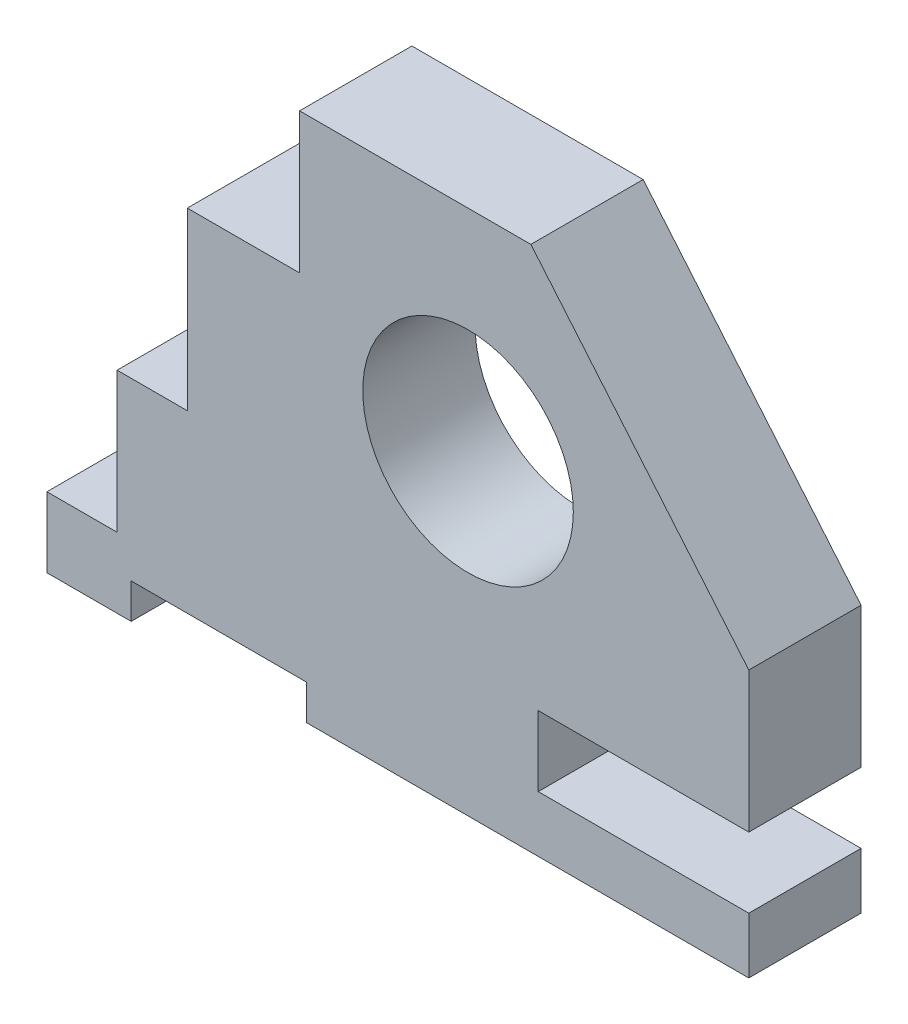
ISO-10303-21;
HEADER;
FILE_DESCRIPTION(('STEP AP214'),'2;1');
FILE_NAME('part.step','',(''),(''),'','','');
FILE_SCHEMA(('AUTOMOTIVE_DESIGN { 1 0 10303 214 1 1 1 1 }'));
ENDSEC;
DATA;
#1=APPLICATION_CONTEXT('core data for automotive mechanical design processes');
#2=APPLICATION_PROTOCOL_DEFINITION('international standard','automotive_design',2000,#1);
#3=PRODUCT_CONTEXT('',#1,'mechanical');
#4=PRODUCT('Part','Part','',(#3));
#5=PRODUCT_RELATED_PRODUCT_CATEGORY('part','',(#4));
#6=PRODUCT_DEFINITION_FORMATION('','',#4);
#7=PRODUCT_DEFINITION_CONTEXT('part definition',#1,'design');
#8=PRODUCT_DEFINITION('design','',#6,#7);
#9=PRODUCT_DEFINITION_SHAPE('','',#8);
#10=(LENGTH_UNIT() NAMED_UNIT(*) SI_UNIT(.MILLI.,.METRE.));
#11=(NAMED_UNIT(*) PLANE_ANGLE_UNIT() SI_UNIT($,.RADIAN.));
#12=(NAMED_UNIT(*) SI_UNIT($,.STERADIAN.) SOLID_ANGLE_UNIT());
#13=UNCERTAINTY_MEASURE_WITH_UNIT(LENGTH_MEASURE(1.E-05),#10,'distance_accuracy_value','');
#14=(GEOMETRIC_REPRESENTATION_CONTEXT(3) GLOBAL_UNCERTAINTY_ASSIGNED_CONTEXT((#13)) GLOBAL_UNIT_ASSIGNED_CONTEXT((#10,
#11,#12)) REPRESENTATION_CONTEXT('',''));
#15=CARTESIAN_POINT('',(0.,0.,0.));
#16=DIRECTION('',(0.,0.,1.));
#17=DIRECTION('',(1.,0.,0.));
#18=AXIS2_PLACEMENT_3D('',#15,#16,#17);
#19=CARTESIAN_POINT('',(0.,0.,16.));
#20=DIRECTION('',(0.,0.,1.));
#21=DIRECTION('',(1.,0.,0.));
#22=AXIS2_PLACEMENT_3D('',#19,#20,#21);
#23=PLANE('',#22);
#24=DIRECTION('',(1.,0.,0.));
#25=VECTOR('',#24,1.);
#26=CARTESIAN_POINT('',(-38.,-37.5,16.));
#27=LINE('',#26,#25);
#28=CARTESIAN_POINT('',(-50.,-37.5,16.));
#29=VERTEX_POINT('',#28);
#30=CARTESIAN_POINT('',(-38.,-37.5,16.));
#31=VERTEX_POINT('',#30);
#32=EDGE_CURVE('E263',#29,#31,#27,.T.);
#33=ORIENTED_EDGE('',*,*,#32,.T.);
#34=DIRECTION('',(0.,1.,0.));
#35=VECTOR('',#34,1.);
#36=CARTESIAN_POINT('',(-38.,-37.5,16.));
#37=LINE('',#36,#35);
#38=CARTESIAN_POINT('',(-38.,-32.5,16.));
#39=VERTEX_POINT('',#38);
#40=EDGE_CURVE('E132',#31,#39,#37,.T.);
#41=ORIENTED_EDGE('',*,*,#40,.T.);
#42=DIRECTION('',(1.,0.,0.));
#43=VECTOR('',#42,1.);
#44=CARTESIAN_POINT('',(-38.,-32.5,16.));
#45=LINE('',#44,#43);
#46=CARTESIAN_POINT('',(-13.,-32.5,16.));
#47=VERTEX_POINT('',#46);
#48=EDGE_CURVE('E329',#39,#47,#45,.T.);
#49=ORIENTED_EDGE('',*,*,#48,.T.);
#50=DIRECTION('',(0.,-1.,0.));
#51=VECTOR('',#50,1.);
#52=CARTESIAN_POINT('',(-13.,-37.5,16.));
#53=LINE('',#52,#51);
#54=CARTESIAN_POINT('',(-13.,-37.5,16.));
#55=VERTEX_POINT('',#54);
#56=EDGE_CURVE('E349',#47,#55,#53,.T.);
#57=ORIENTED_EDGE('',*,*,#56,.T.);
#58=DIRECTION('',(1.,0.,0.));
#59=VECTOR('',#58,1.);
#60=CARTESIAN_POINT('',(50.,-37.5,16.));
#61=LINE('',#60,#59);
#62=CARTESIAN_POINT('',(50.,-37.5,16.));
#63=VERTEX_POINT('',#62);
#64=EDGE_CURVE('E345',#55,#63,#61,.T.);
#65=ORIENTED_EDGE('',*,*,#64,.T.);
#66=DIRECTION('',(0.,1.,0.));
#67=VECTOR('',#66,1.);
#68=CARTESIAN_POINT('',(50.,-29.5,16.));
#69=LINE('',#68,#67);
#70=CARTESIAN_POINT('',(50.,-29.5,16.));
#71=VERTEX_POINT('',#70);
#72=EDGE_CURVE('E348',#63,#71,#69,.T.);
#73=ORIENTED_EDGE('',*,*,#72,.T.);
#74=DIRECTION('',(-1.,0.,0.));
#75=VECTOR('',#74,1.);
#76=CARTESIAN_POINT('',(20.,-29.5,16.));
#77=LINE('',#76,#75);
#78=CARTESIAN_POINT('',(20.,-29.5,16.));
#79=VERTEX_POINT('',#78);
#80=EDGE_CURVE('E354',#71,#79,#77,.T.);
#81=ORIENTED_EDGE('',*,*,#80,.T.);
#82=DIRECTION('',(0.,1.,0.));
#83=VECTOR('',#82,1.);
#84=CARTESIAN_POINT('',(20.,-29.5,16.));
#85=LINE('',#84,#83);
#86=CARTESIAN_POINT('',(20.,-19.5,16.));
#87=VERTEX_POINT('',#86);
#88=EDGE_CURVE('E361',#79,#87,#85,.T.);
#89=ORIENTED_EDGE('',*,*,#88,.T.);
#90=DIRECTION('',(1.,0.,0.));
#91=VECTOR('',#90,1.);
#92=CARTESIAN_POINT('',(20.,-19.5,16.));
#93=LINE('',#92,#91);
#94=CARTESIAN_POINT('',(50.,-19.5,16.));
#95=VERTEX_POINT('',#94);
#96=EDGE_CURVE('E364',#87,#95,#93,.T.);
#97=ORIENTED_EDGE('',*,*,#96,.T.);
#98=DIRECTION('',(0.,1.,0.));
#99=VECTOR('',#98,1.);
#100=CARTESIAN_POINT('',(50.,0.499999999999966,16.));
#101=LINE('',#100,#99);
#102=CARTESIAN_POINT('',(50.,0.499999999999966,16.));
#103=VERTEX_POINT('',#102);
#104=EDGE_CURVE('E367',#95,#103,#101,.T.);
#105=ORIENTED_EDGE('',*,*,#104,.T.);
#106=DIRECTION('',(-0.642787609686541,0.766044443118977,0.));
#107=VECTOR('',#106,1.);
#108=CARTESIAN_POINT('',(18.9533136464405,37.5,16.));
#109=LINE('',#108,#107);
#110=CARTESIAN_POINT('',(18.9533136464405,37.5,16.));
#111=VERTEX_POINT('',#110);
#112=EDGE_CURVE('E370',#103,#111,#109,.T.);
#113=ORIENTED_EDGE('',*,*,#112,.T.);
#114=DIRECTION('',(-1.,0.,0.));
#115=VECTOR('',#114,1.);
#116=CARTESIAN_POINT('',(18.9533136464405,37.5,16.));
#117=LINE('',#116,#115);
#118=CARTESIAN_POINT('',(-14.,37.5,16.));
#119=VERTEX_POINT('',#118);
#120=EDGE_CURVE('E373',#111,#119,#117,.T.);
#121=ORIENTED_EDGE('',*,*,#120,.T.);
#122=DIRECTION('',(0.,-1.,0.));
#123=VECTOR('',#122,1.);
#124=CARTESIAN_POINT('',(-14.,37.5,16.));
#125=LINE('',#124,#123);
#126=CARTESIAN_POINT('',(-14.,17.5,16.));
#127=VERTEX_POINT('',#126);
#128=EDGE_CURVE('E376',#119,#127,#125,.T.);
#129=ORIENTED_EDGE('',*,*,#128,.T.);
#130=DIRECTION('',(-1.,0.,0.));
#131=VECTOR('',#130,1.);
#132=CARTESIAN_POINT('',(-30.,17.5,16.));
#133=LINE('',#132,#131);
#134=CARTESIAN_POINT('',(-30.,17.5,16.));
#135=VERTEX_POINT('',#134);
#136=EDGE_CURVE('E379',#127,#135,#133,.T.);
#137=ORIENTED_EDGE('',*,*,#136,.T.);
#138=DIRECTION('',(0.,-1.,0.));
#139=VECTOR('',#138,1.);
#140=CARTESIAN_POINT('',(-30.,17.5,16.));
#141=LINE('',#140,#139);
#142=CARTESIAN_POINT('',(-30.,-7.50000000000002,16.));
#143=VERTEX_POINT('',#142);
#144=EDGE_CURVE('E382',#135,#143,#141,.T.);
#145=ORIENTED_EDGE('',*,*,#144,.T.);
#146=DIRECTION('',(-1.,0.,0.));
#147=VECTOR('',#146,1.);
#148=CARTESIAN_POINT('',(-40.,-7.50000000000002,16.));
#149=LINE('',#148,#147);
#150=CARTESIAN_POINT('',(-40.,-7.50000000000002,16.));
#151=VERTEX_POINT('',#150);
#152=EDGE_CURVE('E184',#143,#151,#149,.T.);
#153=ORIENTED_EDGE('',*,*,#152,.T.);
#154=DIRECTION('',(0.,-1.,0.));
#155=VECTOR('',#154,1.);
#156=CARTESIAN_POINT('',(-40.,-7.50000000000002,16.));
#157=LINE('',#156,#155);
#158=CARTESIAN_POINT('',(-40.,-27.5,16.));
#159=VERTEX_POINT('',#158);
#160=EDGE_CURVE('E178',#151,#159,#157,.T.);
#161=ORIENTED_EDGE('',*,*,#160,.T.);
#162=DIRECTION('',(-1.,0.,0.));
#163=VECTOR('',#162,1.);
#164=CARTESIAN_POINT('',(-50.,-27.5,16.));
#165=LINE('',#164,#163);
#166=CARTESIAN_POINT('',(-50.,-27.5,16.));
#167=VERTEX_POINT('',#166);
#168=EDGE_CURVE('E182',#159,#167,#165,.T.);
#169=ORIENTED_EDGE('',*,*,#168,.T.);
#170=DIRECTION('',(0.,-1.,0.));
#171=VECTOR('',#170,1.);
#172=CARTESIAN_POINT('',(-50.,-27.5,16.));
#173=LINE('',#172,#171);
#174=EDGE_CURVE('E56',#167,#29,#173,.T.);
#175=ORIENTED_EDGE('',*,*,#174,.T.);
#176=EDGE_LOOP('',(#33,#41,#49,#57,#65,#73,#81,#89,#97,#105,#113,#121,#129,#137,#145,#153,#161,
#169,#175));
#177=FACE_BOUND('',#176,.T.);
#178=CARTESIAN_POINT('',(10.,7.49999999999996,16.));
#179=DIRECTION('',(0.,0.,1.));
#180=DIRECTION('',(1.,0.,0.));
#181=AXIS2_PLACEMENT_3D('',#178,#179,#180);
#182=CIRCLE('',#181,15.);
#183=CARTESIAN_POINT('',(25.,7.49999999999996,16.));
#184=VERTEX_POINT('',#183);
#185=EDGE_CURVE('E212',#184,#184,#182,.T.);
#186=ORIENTED_EDGE('',*,*,#185,.F.);
#187=EDGE_LOOP('',(#186));
#188=FACE_BOUND('',#187,.T.);
#189=ADVANCED_FACE('F38',(#177,#188),#23,.T.);
#190=CARTESIAN_POINT('',(0.,0.,0.));
#191=DIRECTION('',(0.,0.,1.));
#192=DIRECTION('',(1.,0.,0.));
#193=AXIS2_PLACEMENT_3D('',#190,#191,#192);
#194=PLANE('',#193);
#195=DIRECTION('',(1.,0.,0.));
#196=VECTOR('',#195,1.);
#197=CARTESIAN_POINT('',(-38.,-37.5,0.));
#198=LINE('',#197,#196);
#199=CARTESIAN_POINT('',(-50.,-37.5,0.));
#200=VERTEX_POINT('',#199);
#201=CARTESIAN_POINT('',(-38.,-37.5,0.));
#202=VERTEX_POINT('',#201);
#203=EDGE_CURVE('E207',#200,#202,#198,.T.);
#204=ORIENTED_EDGE('',*,*,#203,.F.);
#205=DIRECTION('',(0.,-1.,0.));
#206=VECTOR('',#205,1.);
#207=CARTESIAN_POINT('',(-50.,-27.5,0.));
#208=LINE('',#207,#206);
#209=CARTESIAN_POINT('',(-50.,-27.5,0.));
#210=VERTEX_POINT('',#209);
#211=EDGE_CURVE('E124',#210,#200,#208,.T.);
#212=ORIENTED_EDGE('',*,*,#211,.F.);
#213=DIRECTION('',(-1.,0.,0.));
#214=VECTOR('',#213,1.);
#215=CARTESIAN_POINT('',(-50.,-27.5,0.));
#216=LINE('',#215,#214);
#217=CARTESIAN_POINT('',(-40.,-27.5,0.));
#218=VERTEX_POINT('',#217);
#219=EDGE_CURVE('E118',#218,#210,#216,.T.);
#220=ORIENTED_EDGE('',*,*,#219,.F.);
#221=DIRECTION('',(0.,-1.,0.));
#222=VECTOR('',#221,1.);
#223=CARTESIAN_POINT('',(-40.,-7.50000000000002,0.));
#224=LINE('',#223,#222);
#225=CARTESIAN_POINT('',(-40.,-7.50000000000002,0.));
#226=VERTEX_POINT('',#225);
#227=EDGE_CURVE('E193',#226,#218,#224,.T.);
#228=ORIENTED_EDGE('',*,*,#227,.F.);
#229=DIRECTION('',(-1.,0.,0.));
#230=VECTOR('',#229,1.);
#231=CARTESIAN_POINT('',(-40.,-7.50000000000002,0.));
#232=LINE('',#231,#230);
#233=CARTESIAN_POINT('',(-30.,-7.50000000000002,0.));
#234=VERTEX_POINT('',#233);
#235=EDGE_CURVE('E254',#234,#226,#232,.T.);
#236=ORIENTED_EDGE('',*,*,#235,.F.);
#237=DIRECTION('',(0.,-1.,0.));
#238=VECTOR('',#237,1.);
#239=CARTESIAN_POINT('',(-30.,17.5,0.));
#240=LINE('',#239,#238);
#241=CARTESIAN_POINT('',(-30.,17.5,0.));
#242=VERTEX_POINT('',#241);
#243=EDGE_CURVE('E251',#242,#234,#240,.T.);
#244=ORIENTED_EDGE('',*,*,#243,.F.);
#245=DIRECTION('',(-1.,0.,0.));
#246=VECTOR('',#245,1.);
#247=CARTESIAN_POINT('',(-30.,17.5,0.));
#248=LINE('',#247,#246);
#249=CARTESIAN_POINT('',(-14.,17.5,0.));
#250=VERTEX_POINT('',#249);
#251=EDGE_CURVE('E248',#250,#242,#248,.T.);
#252=ORIENTED_EDGE('',*,*,#251,.F.);
#253=DIRECTION('',(0.,-1.,0.));
#254=VECTOR('',#253,1.);
#255=CARTESIAN_POINT('',(-14.,37.5,0.));
#256=LINE('',#255,#254);
#257=CARTESIAN_POINT('',(-14.,37.5,0.));
#258=VERTEX_POINT('',#257);
#259=EDGE_CURVE('E245',#258,#250,#256,.T.);
#260=ORIENTED_EDGE('',*,*,#259,.F.);
#261=DIRECTION('',(-1.,0.,0.));
#262=VECTOR('',#261,1.);
#263=CARTESIAN_POINT('',(18.9533136464405,37.5,0.));
#264=LINE('',#263,#262);
#265=CARTESIAN_POINT('',(18.9533136464405,37.5,0.));
#266=VERTEX_POINT('',#265);
#267=EDGE_CURVE('E242',#266,#258,#264,.T.);
#268=ORIENTED_EDGE('',*,*,#267,.F.);
#269=DIRECTION('',(-0.642787609686541,0.766044443118977,0.));
#270=VECTOR('',#269,1.);
#271=CARTESIAN_POINT('',(18.9533136464405,37.5,0.));
#272=LINE('',#271,#270);
#273=CARTESIAN_POINT('',(50.,0.499999999999966,0.));
#274=VERTEX_POINT('',#273);
#275=EDGE_CURVE('E239',#274,#266,#272,.T.);
#276=ORIENTED_EDGE('',*,*,#275,.F.);
#277=DIRECTION('',(0.,1.,0.));
#278=VECTOR('',#277,1.);
#279=CARTESIAN_POINT('',(50.,0.499999999999966,0.));
#280=LINE('',#279,#278);
#281=CARTESIAN_POINT('',(50.,-19.5,0.));
#282=VERTEX_POINT('',#281);
#283=EDGE_CURVE('E236',#282,#274,#280,.T.);
#284=ORIENTED_EDGE('',*,*,#283,.F.);
#285=DIRECTION('',(1.,0.,0.));
#286=VECTOR('',#285,1.);
#287=CARTESIAN_POINT('',(20.,-19.5,0.));
#288=LINE('',#287,#286);
#289=CARTESIAN_POINT('',(20.,-19.5,0.));
#290=VERTEX_POINT('',#289);
#291=EDGE_CURVE('E233',#290,#282,#288,.T.);
#292=ORIENTED_EDGE('',*,*,#291,.F.);
#293=DIRECTION('',(0.,1.,0.));
#294=VECTOR('',#293,1.);
#295=CARTESIAN_POINT('',(20.,-29.5,0.));
#296=LINE('',#295,#294);
#297=CARTESIAN_POINT('',(20.,-29.5,0.));
#298=VERTEX_POINT('',#297);
#299=EDGE_CURVE('E230',#298,#290,#296,.T.);
#300=ORIENTED_EDGE('',*,*,#299,.F.);
#301=DIRECTION('',(-1.,0.,0.));
#302=VECTOR('',#301,1.);
#303=CARTESIAN_POINT('',(20.,-29.5,0.));
#304=LINE('',#303,#302);
#305=CARTESIAN_POINT('',(50.,-29.5,0.));
#306=VERTEX_POINT('',#305);
#307=EDGE_CURVE('E227',#306,#298,#304,.T.);
#308=ORIENTED_EDGE('',*,*,#307,.F.);
#309=DIRECTION('',(0.,1.,0.));
#310=VECTOR('',#309,1.);
#311=CARTESIAN_POINT('',(50.,-29.5,0.));
#312=LINE('',#311,#310);
#313=CARTESIAN_POINT('',(50.,-37.5,0.));
#314=VERTEX_POINT('',#313);
#315=EDGE_CURVE('E224',#314,#306,#312,.T.);
#316=ORIENTED_EDGE('',*,*,#315,.F.);
#317=DIRECTION('',(1.,0.,0.));
#318=VECTOR('',#317,1.);
#319=CARTESIAN_POINT('',(50.,-37.5,0.));
#320=LINE('',#319,#318);
#321=CARTESIAN_POINT('',(-13.,-37.5,0.));
#322=VERTEX_POINT('',#321);
#323=EDGE_CURVE('E221',#322,#314,#320,.T.);
#324=ORIENTED_EDGE('',*,*,#323,.F.);
#325=DIRECTION('',(0.,-1.,0.));
#326=VECTOR('',#325,1.);
#327=CARTESIAN_POINT('',(-13.,-37.5,0.));
#328=LINE('',#327,#326);
#329=CARTESIAN_POINT('',(-13.,-32.5,0.));
#330=VERTEX_POINT('',#329);
#331=EDGE_CURVE('E218',#330,#322,#328,.T.);
#332=ORIENTED_EDGE('',*,*,#331,.F.);
#333=DIRECTION('',(1.,0.,0.));
#334=VECTOR('',#333,1.);
#335=CARTESIAN_POINT('',(-38.,-32.5,0.));
#336=LINE('',#335,#334);
#337=CARTESIAN_POINT('',(-38.,-32.5,0.));
#338=VERTEX_POINT('',#337);
#339=EDGE_CURVE('E215',#338,#330,#336,.T.);
#340=ORIENTED_EDGE('',*,*,#339,.F.);
#341=DIRECTION('',(0.,1.,0.));
#342=VECTOR('',#341,1.);
#343=CARTESIAN_POINT('',(-38.,-37.5,0.));
#344=LINE('',#343,#342);
#345=EDGE_CURVE('E211',#202,#338,#344,.T.);
#346=ORIENTED_EDGE('',*,*,#345,.F.);
#347=EDGE_LOOP('',(#204,#212,#220,#228,#236,#244,#252,#260,#268,#276,#284,#292,#300,#308,#316,
#324,#332,#340,#346));
#348=FACE_BOUND('',#347,.T.);
#349=CARTESIAN_POINT('',(10.,7.49999999999996,0.));
#350=DIRECTION('',(0.,0.,1.));
#351=DIRECTION('',(1.,0.,0.));
#352=AXIS2_PLACEMENT_3D('',#349,#350,#351);
#353=CIRCLE('',#352,15.);
#354=CARTESIAN_POINT('',(25.,7.49999999999996,0.));
#355=VERTEX_POINT('',#354);
#356=EDGE_CURVE('E678',#355,#355,#353,.T.);
#357=ORIENTED_EDGE('',*,*,#356,.T.);
#358=EDGE_LOOP('',(#357));
#359=FACE_BOUND('',#358,.T.);
#360=ADVANCED_FACE('F333',(#348,#359),#194,.F.);
#361=CARTESIAN_POINT('',(-38.,-37.5,16.));
#362=DIRECTION('',(0.,1.,0.));
#363=DIRECTION('',(-1.,0.,0.));
#364=AXIS2_PLACEMENT_3D('',#361,#362,#363);
#365=PLANE('',#364);
#366=ORIENTED_EDGE('',*,*,#203,.T.);
#367=DIRECTION('',(0.,0.,-1.));
#368=VECTOR('',#367,1.);
#369=CARTESIAN_POINT('',(-38.,-37.5,16.));
#370=LINE('',#369,#368);
#371=EDGE_CURVE('E11',#31,#202,#370,.T.);
#372=ORIENTED_EDGE('',*,*,#371,.F.);
#373=ORIENTED_EDGE('',*,*,#32,.F.);
#374=DIRECTION('',(0.,0.,-1.));
#375=VECTOR('',#374,1.);
#376=CARTESIAN_POINT('',(-50.,-37.5,16.));
#377=LINE('',#376,#375);
#378=EDGE_CURVE('E203',#29,#200,#377,.T.);
#379=ORIENTED_EDGE('',*,*,#378,.T.);
#380=EDGE_LOOP('',(#366,#372,#373,#379));
#381=FACE_BOUND('',#380,.T.);
#382=ADVANCED_FACE('F40',(#381),#365,.F.);
#383=CARTESIAN_POINT('',(-38.,-37.5,16.));
#384=DIRECTION('',(-1.,0.,0.));
#385=DIRECTION('',(0.,0.,1.));
#386=AXIS2_PLACEMENT_3D('',#383,#384,#385);
#387=PLANE('',#386);
#388=ORIENTED_EDGE('',*,*,#345,.T.);
#389=DIRECTION('',(0.,0.,-1.));
#390=VECTOR('',#389,1.);
#391=CARTESIAN_POINT('',(-38.,-32.5,16.));
#392=LINE('',#391,#390);
#393=EDGE_CURVE('E48',#39,#338,#392,.T.);
#394=ORIENTED_EDGE('',*,*,#393,.F.);
#395=ORIENTED_EDGE('',*,*,#40,.F.);
#396=ORIENTED_EDGE('',*,*,#371,.T.);
#397=EDGE_LOOP('',(#388,#394,#395,#396));
#398=FACE_BOUND('',#397,.T.);
#399=ADVANCED_FACE('F430',(#398),#387,.F.);
#400=CARTESIAN_POINT('',(-38.,-32.5,16.));
#401=DIRECTION('',(0.,1.,0.));
#402=DIRECTION('',(0.,0.,1.));
#403=AXIS2_PLACEMENT_3D('',#400,#401,#402);
#404=PLANE('',#403);
#405=ORIENTED_EDGE('',*,*,#339,.T.);
#406=DIRECTION('',(0.,0.,-1.));
#407=VECTOR('',#406,1.);
#408=CARTESIAN_POINT('',(-13.,-32.5,16.));
#409=LINE('',#408,#407);
#410=EDGE_CURVE('E318',#47,#330,#409,.T.);
#411=ORIENTED_EDGE('',*,*,#410,.F.);
#412=ORIENTED_EDGE('',*,*,#48,.F.);
#413=ORIENTED_EDGE('',*,*,#393,.T.);
#414=EDGE_LOOP('',(#405,#411,#412,#413));
#415=FACE_BOUND('',#414,.T.);
#416=ADVANCED_FACE('F327',(#415),#404,.F.);
#417=CARTESIAN_POINT('',(-13.,-37.5,16.));
#418=DIRECTION('',(1.,0.,0.));
#419=DIRECTION('',(0.,0.,-1.));
#420=AXIS2_PLACEMENT_3D('',#417,#418,#419);
#421=PLANE('',#420);
#422=ORIENTED_EDGE('',*,*,#331,.T.);
#423=DIRECTION('',(0.,0.,-1.));
#424=VECTOR('',#423,1.);
#425=CARTESIAN_POINT('',(-13.,-37.5,16.));
#426=LINE('',#425,#424);
#427=EDGE_CURVE('E314',#55,#322,#426,.T.);
#428=ORIENTED_EDGE('',*,*,#427,.F.);
#429=ORIENTED_EDGE('',*,*,#56,.F.);
#430=ORIENTED_EDGE('',*,*,#410,.T.);
#431=EDGE_LOOP('',(#422,#428,#429,#430));
#432=FACE_BOUND('',#431,.T.);
#433=ADVANCED_FACE('F339',(#432),#421,.F.);
#434=CARTESIAN_POINT('',(50.,-37.5,16.));
#435=DIRECTION('',(0.,1.,0.));
#436=DIRECTION('',(-1.,0.,0.));
#437=AXIS2_PLACEMENT_3D('',#434,#435,#436);
#438=PLANE('',#437);
#439=ORIENTED_EDGE('',*,*,#323,.T.);
#440=DIRECTION('',(0.,0.,-1.));
#441=VECTOR('',#440,1.);
#442=CARTESIAN_POINT('',(50.,-37.5,16.));
#443=LINE('',#442,#441);
#444=EDGE_CURVE('E310',#63,#314,#443,.T.);
#445=ORIENTED_EDGE('',*,*,#444,.F.);
#446=ORIENTED_EDGE('',*,*,#64,.F.);
#447=ORIENTED_EDGE('',*,*,#427,.T.);
#448=EDGE_LOOP('',(#439,#445,#446,#447));
#449=FACE_BOUND('',#448,.T.);
#450=ADVANCED_FACE('F343',(#449),#438,.F.);
#451=CARTESIAN_POINT('',(50.,-29.5,16.));
#452=DIRECTION('',(-1.,0.,0.));
#453=DIRECTION('',(0.,-1.,0.));
#454=AXIS2_PLACEMENT_3D('',#451,#452,#453);
#455=PLANE('',#454);
#456=ORIENTED_EDGE('',*,*,#315,.T.);
#457=DIRECTION('',(0.,0.,-1.));
#458=VECTOR('',#457,1.);
#459=CARTESIAN_POINT('',(50.,-29.5,16.));
#460=LINE('',#459,#458);
#461=EDGE_CURVE('E306',#71,#306,#460,.T.);
#462=ORIENTED_EDGE('',*,*,#461,.F.);
#463=ORIENTED_EDGE('',*,*,#72,.F.);
#464=ORIENTED_EDGE('',*,*,#444,.T.);
#465=EDGE_LOOP('',(#456,#462,#463,#464));
#466=FACE_BOUND('',#465,.T.);
#467=ADVANCED_FACE('F443',(#466),#455,.F.);
#468=CARTESIAN_POINT('',(20.,-29.5,16.));
#469=DIRECTION('',(0.,-1.,0.));
#470=DIRECTION('',(0.,0.,-1.));
#471=AXIS2_PLACEMENT_3D('',#468,#469,#470);
#472=PLANE('',#471);
#473=ORIENTED_EDGE('',*,*,#307,.T.);
#474=DIRECTION('',(0.,0.,-1.));
#475=VECTOR('',#474,1.);
#476=CARTESIAN_POINT('',(20.,-29.5,16.));
#477=LINE('',#476,#475);
#478=EDGE_CURVE('E302',#79,#298,#477,.T.);
#479=ORIENTED_EDGE('',*,*,#478,.F.);
#480=ORIENTED_EDGE('',*,*,#80,.F.);
#481=ORIENTED_EDGE('',*,*,#461,.T.);
#482=EDGE_LOOP('',(#473,#479,#480,#481));
#483=FACE_BOUND('',#482,.T.);
#484=ADVANCED_FACE('F446',(#483),#472,.F.);
#485=CARTESIAN_POINT('',(20.,-29.5,16.));
#486=DIRECTION('',(-1.,0.,0.));
#487=DIRECTION('',(0.,0.,1.));
#488=AXIS2_PLACEMENT_3D('',#485,#486,#487);
#489=PLANE('',#488);
#490=ORIENTED_EDGE('',*,*,#299,.T.);
#491=DIRECTION('',(0.,0.,-1.));
#492=VECTOR('',#491,1.);
#493=CARTESIAN_POINT('',(20.,-19.5,16.));
#494=LINE('',#493,#492);
#495=EDGE_CURVE('E298',#87,#290,#494,.T.);
#496=ORIENTED_EDGE('',*,*,#495,.F.);
#497=ORIENTED_EDGE('',*,*,#88,.F.);
#498=ORIENTED_EDGE('',*,*,#478,.T.);
#499=EDGE_LOOP('',(#490,#496,#497,#498));
#500=FACE_BOUND('',#499,.T.);
#501=ADVANCED_FACE('F450',(#500),#489,.F.);
#502=CARTESIAN_POINT('',(20.,-19.5,16.));
#503=DIRECTION('',(0.,1.,0.));
#504=DIRECTION('',(0.,0.,1.));
#505=AXIS2_PLACEMENT_3D('',#502,#503,#504);
#506=PLANE('',#505);
#507=ORIENTED_EDGE('',*,*,#291,.T.);
#508=DIRECTION('',(0.,0.,-1.));
#509=VECTOR('',#508,1.);
#510=CARTESIAN_POINT('',(50.,-19.5,16.));
#511=LINE('',#510,#509);
#512=EDGE_CURVE('E294',#95,#282,#511,.T.);
#513=ORIENTED_EDGE('',*,*,#512,.F.);
#514=ORIENTED_EDGE('',*,*,#96,.F.);
#515=ORIENTED_EDGE('',*,*,#495,.T.);
#516=EDGE_LOOP('',(#507,#513,#514,#515));
#517=FACE_BOUND('',#516,.T.);
#518=ADVANCED_FACE('F454',(#517),#506,.F.);
#519=CARTESIAN_POINT('',(50.,0.499999999999966,16.));
#520=DIRECTION('',(-1.,0.,0.));
#521=DIRECTION('',(0.,0.,1.));
#522=AXIS2_PLACEMENT_3D('',#519,#520,#521);
#523=PLANE('',#522);
#524=ORIENTED_EDGE('',*,*,#283,.T.);
#525=DIRECTION('',(0.,0.,-1.));
#526=VECTOR('',#525,1.);
#527=CARTESIAN_POINT('',(50.,0.499999999999966,16.));
#528=LINE('',#527,#526);
#529=EDGE_CURVE('E290',#103,#274,#528,.T.);
#530=ORIENTED_EDGE('',*,*,#529,.F.);
#531=ORIENTED_EDGE('',*,*,#104,.F.);
#532=ORIENTED_EDGE('',*,*,#512,.T.);
#533=EDGE_LOOP('',(#524,#530,#531,#532));
#534=FACE_BOUND('',#533,.T.);
#535=ADVANCED_FACE('F458',(#534),#523,.F.);
#536=CARTESIAN_POINT('',(18.9533136464405,37.5,16.));
#537=DIRECTION('',(-0.766044443118977,-0.642787609686541,0.));
#538=DIRECTION('',(0.642787609686541,-0.766044443118977,0.));
#539=AXIS2_PLACEMENT_3D('',#536,#537,#538);
#540=PLANE('',#539);
#541=ORIENTED_EDGE('',*,*,#275,.T.);
#542=DIRECTION('',(0.,0.,-1.));
#543=VECTOR('',#542,1.);
#544=CARTESIAN_POINT('',(18.9533136464405,37.5,16.));
#545=LINE('',#544,#543);
#546=EDGE_CURVE('E286',#111,#266,#545,.T.);
#547=ORIENTED_EDGE('',*,*,#546,.F.);
#548=ORIENTED_EDGE('',*,*,#112,.F.);
#549=ORIENTED_EDGE('',*,*,#529,.T.);
#550=EDGE_LOOP('',(#541,#547,#548,#549));
#551=FACE_BOUND('',#550,.T.);
#552=ADVANCED_FACE('F462',(#551),#540,.F.);
#553=CARTESIAN_POINT('',(18.9533136464405,37.5,16.));
#554=DIRECTION('',(0.,-1.,0.));
#555=DIRECTION('',(1.,0.,0.));
#556=AXIS2_PLACEMENT_3D('',#553,#554,#555);
#557=PLANE('',#556);
#558=ORIENTED_EDGE('',*,*,#267,.T.);
#559=DIRECTION('',(0.,0.,-1.));
#560=VECTOR('',#559,1.);
#561=CARTESIAN_POINT('',(-14.,37.5,16.));
#562=LINE('',#561,#560);
#563=EDGE_CURVE('E282',#119,#258,#562,.T.);
#564=ORIENTED_EDGE('',*,*,#563,.F.);
#565=ORIENTED_EDGE('',*,*,#120,.F.);
#566=ORIENTED_EDGE('',*,*,#546,.T.);
#567=EDGE_LOOP('',(#558,#564,#565,#566));
#568=FACE_BOUND('',#567,.T.);
#569=ADVANCED_FACE('F466',(#568),#557,.F.);
#570=CARTESIAN_POINT('',(-14.,37.5,16.));
#571=DIRECTION('',(1.,0.,0.));
#572=DIRECTION('',(0.,1.,0.));
#573=AXIS2_PLACEMENT_3D('',#570,#571,#572);
#574=PLANE('',#573);
#575=ORIENTED_EDGE('',*,*,#259,.T.);
#576=DIRECTION('',(0.,0.,-1.));
#577=VECTOR('',#576,1.);
#578=CARTESIAN_POINT('',(-14.,17.5,16.));
#579=LINE('',#578,#577);
#580=EDGE_CURVE('E278',#127,#250,#579,.T.);
#581=ORIENTED_EDGE('',*,*,#580,.F.);
#582=ORIENTED_EDGE('',*,*,#128,.F.);
#583=ORIENTED_EDGE('',*,*,#563,.T.);
#584=EDGE_LOOP('',(#575,#581,#582,#583));
#585=FACE_BOUND('',#584,.T.);
#586=ADVANCED_FACE('F470',(#585),#574,.F.);
#587=CARTESIAN_POINT('',(-30.,17.5,16.));
#588=DIRECTION('',(0.,-1.,0.));
#589=DIRECTION('',(0.,0.,-1.));
#590=AXIS2_PLACEMENT_3D('',#587,#588,#589);
#591=PLANE('',#590);
#592=ORIENTED_EDGE('',*,*,#251,.T.);
#593=DIRECTION('',(0.,0.,-1.));
#594=VECTOR('',#593,1.);
#595=CARTESIAN_POINT('',(-30.,17.5,16.));
#596=LINE('',#595,#594);
#597=EDGE_CURVE('E274',#135,#242,#596,.T.);
#598=ORIENTED_EDGE('',*,*,#597,.F.);
#599=ORIENTED_EDGE('',*,*,#136,.F.);
#600=ORIENTED_EDGE('',*,*,#580,.T.);
#601=EDGE_LOOP('',(#592,#598,#599,#600));
#602=FACE_BOUND('',#601,.T.);
#603=ADVANCED_FACE('F474',(#602),#591,.F.);
#604=CARTESIAN_POINT('',(-30.,17.5,16.));
#605=DIRECTION('',(1.,0.,0.));
#606=DIRECTION('',(0.,1.,0.));
#607=AXIS2_PLACEMENT_3D('',#604,#605,#606);
#608=PLANE('',#607);
#609=ORIENTED_EDGE('',*,*,#243,.T.);
#610=DIRECTION('',(0.,0.,-1.));
#611=VECTOR('',#610,1.);
#612=CARTESIAN_POINT('',(-30.,-7.50000000000002,16.));
#613=LINE('',#612,#611);
#614=EDGE_CURVE('E270',#143,#234,#613,.T.);
#615=ORIENTED_EDGE('',*,*,#614,.F.);
#616=ORIENTED_EDGE('',*,*,#144,.F.);
#617=ORIENTED_EDGE('',*,*,#597,.T.);
#618=EDGE_LOOP('',(#609,#615,#616,#617));
#619=FACE_BOUND('',#618,.T.);
#620=ADVANCED_FACE('F402',(#619),#608,.F.);
#621=CARTESIAN_POINT('',(-40.,-7.50000000000002,16.));
#622=DIRECTION('',(0.,-1.,0.));
#623=DIRECTION('',(0.,0.,-1.));
#624=AXIS2_PLACEMENT_3D('',#621,#622,#623);
#625=PLANE('',#624);
#626=ORIENTED_EDGE('',*,*,#235,.T.);
#627=DIRECTION('',(0.,0.,-1.));
#628=VECTOR('',#627,1.);
#629=CARTESIAN_POINT('',(-40.,-7.50000000000002,16.));
#630=LINE('',#629,#628);
#631=EDGE_CURVE('E195',#151,#226,#630,.T.);
#632=ORIENTED_EDGE('',*,*,#631,.F.);
#633=ORIENTED_EDGE('',*,*,#152,.F.);
#634=ORIENTED_EDGE('',*,*,#614,.T.);
#635=EDGE_LOOP('',(#626,#632,#633,#634));
#636=FACE_BOUND('',#635,.T.);
#637=ADVANCED_FACE('F406',(#636),#625,.F.);
#638=CARTESIAN_POINT('',(-40.,-7.50000000000002,16.));
#639=DIRECTION('',(1.,0.,0.));
#640=DIRECTION('',(0.,0.,-1.));
#641=AXIS2_PLACEMENT_3D('',#638,#639,#640);
#642=PLANE('',#641);
#643=ORIENTED_EDGE('',*,*,#227,.T.);
#644=DIRECTION('',(0.,0.,-1.));
#645=VECTOR('',#644,1.);
#646=CARTESIAN_POINT('',(-40.,-27.5,16.));
#647=LINE('',#646,#645);
#648=EDGE_CURVE('E190',#159,#218,#647,.T.);
#649=ORIENTED_EDGE('',*,*,#648,.F.);
#650=ORIENTED_EDGE('',*,*,#160,.F.);
#651=ORIENTED_EDGE('',*,*,#631,.T.);
#652=EDGE_LOOP('',(#643,#649,#650,#651));
#653=FACE_BOUND('',#652,.T.);
#654=ADVANCED_FACE('F191',(#653),#642,.F.);
#655=CARTESIAN_POINT('',(-50.,-27.5,16.));
#656=DIRECTION('',(0.,-1.,0.));
#657=DIRECTION('',(0.,0.,-1.));
#658=AXIS2_PLACEMENT_3D('',#655,#656,#657);
#659=PLANE('',#658);
#660=ORIENTED_EDGE('',*,*,#219,.T.);
#661=DIRECTION('',(0.,0.,-1.));
#662=VECTOR('',#661,1.);
#663=CARTESIAN_POINT('',(-50.,-27.5,16.));
#664=LINE('',#663,#662);
#665=EDGE_CURVE('E196',#167,#210,#664,.T.);
#666=ORIENTED_EDGE('',*,*,#665,.F.);
#667=ORIENTED_EDGE('',*,*,#168,.F.);
#668=ORIENTED_EDGE('',*,*,#648,.T.);
#669=EDGE_LOOP('',(#660,#666,#667,#668));
#670=FACE_BOUND('',#669,.T.);
#671=ADVANCED_FACE('F198',(#670),#659,.F.);
#672=CARTESIAN_POINT('',(-50.,-27.5,16.));
#673=DIRECTION('',(1.,0.,0.));
#674=DIRECTION('',(0.,1.,0.));
#675=AXIS2_PLACEMENT_3D('',#672,#673,#674);
#676=PLANE('',#675);
#677=ORIENTED_EDGE('',*,*,#211,.T.);
#678=ORIENTED_EDGE('',*,*,#378,.F.);
#679=ORIENTED_EDGE('',*,*,#174,.F.);
#680=ORIENTED_EDGE('',*,*,#665,.T.);
#681=EDGE_LOOP('',(#677,#678,#679,#680));
#682=FACE_BOUND('',#681,.T.);
#683=ADVANCED_FACE('F410',(#682),#676,.F.);
#684=CARTESIAN_POINT('',(10.,7.49999999999996,16.));
#685=DIRECTION('',(0.,0.,-1.));
#686=DIRECTION('',(-1.,0.,0.));
#687=AXIS2_PLACEMENT_3D('',#684,#685,#686);
#688=CYLINDRICAL_SURFACE('',#687,15.);
#689=ORIENTED_EDGE('',*,*,#185,.T.);
#690=EDGE_LOOP('',(#689));
#691=FACE_BOUND('',#690,.T.);
#692=ORIENTED_EDGE('',*,*,#356,.F.);
#693=EDGE_LOOP('',(#692));
#694=FACE_BOUND('',#693,.T.);
#695=ADVANCED_FACE('F412',(#691,#694),#688,.F.);
#696=CLOSED_SHELL('',(#189,#360,#382,#399,#416,#433,#450,#467,#484,#501,#518,#535,#552,#569,
#586,#603,#620,#637,#654,#671,#683,#695));
#697=MANIFOLD_SOLID_BREP('B2',#696);
#698=ADVANCED_BREP_SHAPE_REPRESENTATION('',(#18,#697),#14);
#699=SHAPE_DEFINITION_REPRESENTATION(#9,#698);
ENDSEC;
END-ISO-10303-21;
